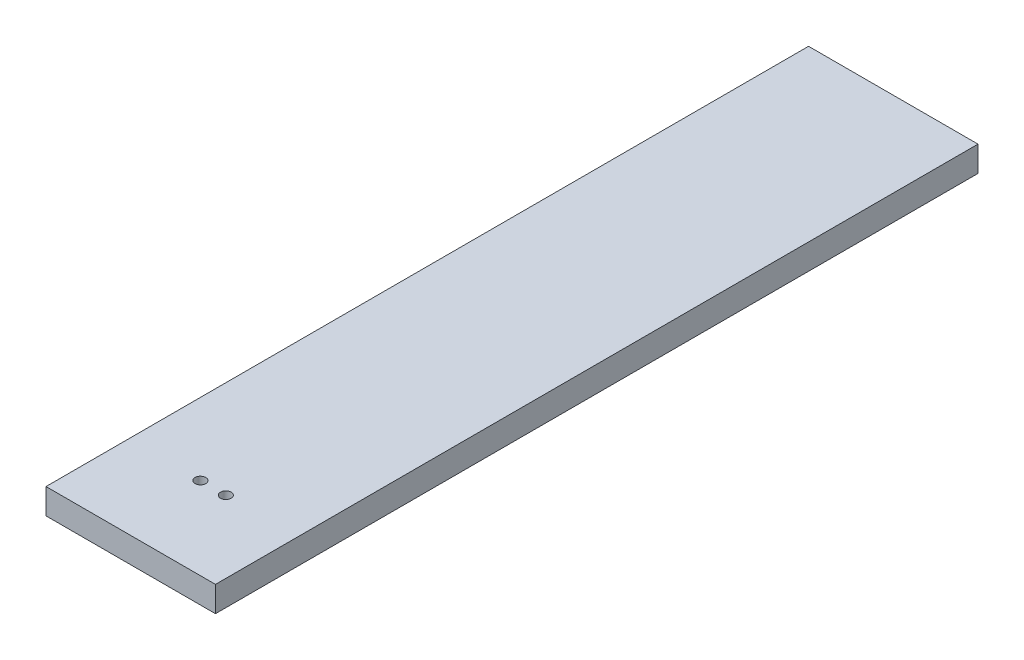
ISO-10303-21;
HEADER;
FILE_DESCRIPTION(('STEP AP214'),'2;1');
FILE_NAME('part.step','',(''),(''),'','','');
FILE_SCHEMA(('AUTOMOTIVE_DESIGN { 1 0 10303 214 1 1 1 1 }'));
ENDSEC;
DATA;
#1=APPLICATION_CONTEXT('core data for automotive mechanical design processes');
#2=APPLICATION_PROTOCOL_DEFINITION('international standard','automotive_design',2000,#1);
#3=PRODUCT_CONTEXT('',#1,'mechanical');
#4=PRODUCT('Part','Part','',(#3));
#5=PRODUCT_RELATED_PRODUCT_CATEGORY('part','',(#4));
#6=PRODUCT_DEFINITION_FORMATION('','',#4);
#7=PRODUCT_DEFINITION_CONTEXT('part definition',#1,'design');
#8=PRODUCT_DEFINITION('design','',#6,#7);
#9=PRODUCT_DEFINITION_SHAPE('','',#8);
#10=(LENGTH_UNIT() NAMED_UNIT(*) SI_UNIT(.MILLI.,.METRE.));
#11=(NAMED_UNIT(*) PLANE_ANGLE_UNIT() SI_UNIT($,.RADIAN.));
#12=(NAMED_UNIT(*) SI_UNIT($,.STERADIAN.) SOLID_ANGLE_UNIT());
#13=UNCERTAINTY_MEASURE_WITH_UNIT(LENGTH_MEASURE(1.E-05),#10,'distance_accuracy_value','');
#14=(GEOMETRIC_REPRESENTATION_CONTEXT(3) GLOBAL_UNCERTAINTY_ASSIGNED_CONTEXT((#13)) GLOBAL_UNIT_ASSIGNED_CONTEXT((#10,
#11,#12)) REPRESENTATION_CONTEXT('',''));
#15=CARTESIAN_POINT('',(0.,0.,0.));
#16=DIRECTION('',(0.,0.,1.));
#17=DIRECTION('',(1.,0.,0.));
#18=AXIS2_PLACEMENT_3D('',#15,#16,#17);
#19=CARTESIAN_POINT('',(7.9375,-2.38125,-35.71875));
#20=DIRECTION('',(1.,0.,0.));
#21=DIRECTION('',(0.,0.,-1.));
#22=AXIS2_PLACEMENT_3D('',#19,#20,#21);
#23=PLANE('',#22);
#24=DIRECTION('',(0.,0.,-1.));
#25=VECTOR('',#24,1.);
#26=CARTESIAN_POINT('',(7.9375,0.,-35.71875));
#27=LINE('',#26,#25);
#28=CARTESIAN_POINT('',(7.93750000000001,0.,35.71875));
#29=VERTEX_POINT('',#28);
#30=CARTESIAN_POINT('',(7.9375,0.,-35.71875));
#31=VERTEX_POINT('',#30);
#32=EDGE_CURVE('E101',#29,#31,#27,.T.);
#33=ORIENTED_EDGE('',*,*,#32,.F.);
#34=DIRECTION('',(0.,1.,0.));
#35=VECTOR('',#34,1.);
#36=CARTESIAN_POINT('',(7.93750000000001,-2.38125,35.71875));
#37=LINE('',#36,#35);
#38=CARTESIAN_POINT('',(7.93750000000001,-2.38125,35.71875));
#39=VERTEX_POINT('',#38);
#40=EDGE_CURVE('E11',#39,#29,#37,.T.);
#41=ORIENTED_EDGE('',*,*,#40,.F.);
#42=DIRECTION('',(0.,0.,-1.));
#43=VECTOR('',#42,1.);
#44=CARTESIAN_POINT('',(7.9375,-2.38125,-35.71875));
#45=LINE('',#44,#43);
#46=CARTESIAN_POINT('',(7.9375,-2.38125,-35.71875));
#47=VERTEX_POINT('',#46);
#48=EDGE_CURVE('E94',#39,#47,#45,.T.);
#49=ORIENTED_EDGE('',*,*,#48,.T.);
#50=DIRECTION('',(0.,1.,0.));
#51=VECTOR('',#50,1.);
#52=CARTESIAN_POINT('',(7.9375,-2.38125,-35.71875));
#53=LINE('',#52,#51);
#54=EDGE_CURVE('E39',#47,#31,#53,.T.);
#55=ORIENTED_EDGE('',*,*,#54,.T.);
#56=EDGE_LOOP('',(#33,#41,#49,#55));
#57=FACE_BOUND('',#56,.T.);
#58=ADVANCED_FACE('F36',(#57),#23,.T.);
#59=CARTESIAN_POINT('',(-7.93749999999999,-2.38125,35.71875));
#60=DIRECTION('',(0.,0.,1.));
#61=DIRECTION('',(1.,0.,0.));
#62=AXIS2_PLACEMENT_3D('',#59,#60,#61);
#63=PLANE('',#62);
#64=DIRECTION('',(1.,0.,0.));
#65=VECTOR('',#64,1.);
#66=CARTESIAN_POINT('',(-7.93749999999999,0.,35.71875));
#67=LINE('',#66,#65);
#68=CARTESIAN_POINT('',(-7.93749999999999,0.,35.71875));
#69=VERTEX_POINT('',#68);
#70=EDGE_CURVE('E96',#69,#29,#67,.T.);
#71=ORIENTED_EDGE('',*,*,#70,.F.);
#72=DIRECTION('',(0.,1.,0.));
#73=VECTOR('',#72,1.);
#74=CARTESIAN_POINT('',(-7.93749999999999,-2.38125,35.71875));
#75=LINE('',#74,#73);
#76=CARTESIAN_POINT('',(-7.93749999999999,-2.38125,35.71875));
#77=VERTEX_POINT('',#76);
#78=EDGE_CURVE('E45',#77,#69,#75,.T.);
#79=ORIENTED_EDGE('',*,*,#78,.F.);
#80=DIRECTION('',(1.,0.,0.));
#81=VECTOR('',#80,1.);
#82=CARTESIAN_POINT('',(-7.93749999999999,-2.38125,35.71875));
#83=LINE('',#82,#81);
#84=EDGE_CURVE('E91',#77,#39,#83,.T.);
#85=ORIENTED_EDGE('',*,*,#84,.T.);
#86=ORIENTED_EDGE('',*,*,#40,.T.);
#87=EDGE_LOOP('',(#71,#79,#85,#86));
#88=FACE_BOUND('',#87,.T.);
#89=ADVANCED_FACE('F112',(#88),#63,.T.);
#90=CARTESIAN_POINT('',(-7.9375,-2.38125,-35.71875));
#91=DIRECTION('',(-1.,0.,0.));
#92=DIRECTION('',(0.,0.,1.));
#93=AXIS2_PLACEMENT_3D('',#90,#91,#92);
#94=PLANE('',#93);
#95=DIRECTION('',(0.,0.,1.));
#96=VECTOR('',#95,1.);
#97=CARTESIAN_POINT('',(-7.9375,0.,-35.71875));
#98=LINE('',#97,#96);
#99=CARTESIAN_POINT('',(-7.9375,0.,-35.71875));
#100=VERTEX_POINT('',#99);
#101=EDGE_CURVE('E86',#100,#69,#98,.T.);
#102=ORIENTED_EDGE('',*,*,#101,.F.);
#103=DIRECTION('',(0.,1.,0.));
#104=VECTOR('',#103,1.);
#105=CARTESIAN_POINT('',(-7.9375,-2.38125,-35.71875));
#106=LINE('',#105,#104);
#107=CARTESIAN_POINT('',(-7.9375,-2.38125,-35.71875));
#108=VERTEX_POINT('',#107);
#109=EDGE_CURVE('E81',#108,#100,#106,.T.);
#110=ORIENTED_EDGE('',*,*,#109,.F.);
#111=DIRECTION('',(0.,0.,1.));
#112=VECTOR('',#111,1.);
#113=CARTESIAN_POINT('',(-7.9375,-2.38125,-35.71875));
#114=LINE('',#113,#112);
#115=EDGE_CURVE('E84',#108,#77,#114,.T.);
#116=ORIENTED_EDGE('',*,*,#115,.T.);
#117=ORIENTED_EDGE('',*,*,#78,.T.);
#118=EDGE_LOOP('',(#102,#110,#116,#117));
#119=FACE_BOUND('',#118,.T.);
#120=ADVANCED_FACE('F83',(#119),#94,.T.);
#121=CARTESIAN_POINT('',(-7.9375,-2.38125,-35.71875));
#122=DIRECTION('',(0.,0.,-1.));
#123=DIRECTION('',(-1.,0.,0.));
#124=AXIS2_PLACEMENT_3D('',#121,#122,#123);
#125=PLANE('',#124);
#126=DIRECTION('',(-1.,0.,0.));
#127=VECTOR('',#126,1.);
#128=CARTESIAN_POINT('',(-7.9375,0.,-35.71875));
#129=LINE('',#128,#127);
#130=EDGE_CURVE('E104',#31,#100,#129,.T.);
#131=ORIENTED_EDGE('',*,*,#130,.F.);
#132=ORIENTED_EDGE('',*,*,#54,.F.);
#133=DIRECTION('',(-1.,0.,0.));
#134=VECTOR('',#133,1.);
#135=CARTESIAN_POINT('',(-7.9375,-2.38125,-35.71875));
#136=LINE('',#135,#134);
#137=EDGE_CURVE('E90',#47,#108,#136,.T.);
#138=ORIENTED_EDGE('',*,*,#137,.T.);
#139=ORIENTED_EDGE('',*,*,#109,.T.);
#140=EDGE_LOOP('',(#131,#132,#138,#139));
#141=FACE_BOUND('',#140,.T.);
#142=ADVANCED_FACE('F93',(#141),#125,.T.);
#143=CARTESIAN_POINT('',(0.,-2.38125,0.));
#144=DIRECTION('',(0.,1.,0.));
#145=DIRECTION('',(0.,0.,1.));
#146=AXIS2_PLACEMENT_3D('',#143,#144,#145);
#147=PLANE('',#146);
#148=CARTESIAN_POINT('',(1.19,-2.38125,28.));
#149=DIRECTION('',(0.,1.,0.));
#150=DIRECTION('',(0.,0.,1.));
#151=AXIS2_PLACEMENT_3D('',#148,#149,#150);
#152=CIRCLE('',#151,0.5);
#153=CARTESIAN_POINT('',(1.19,-2.38125,28.5));
#154=VERTEX_POINT('',#153);
#155=EDGE_CURVE('E145',#154,#154,#152,.T.);
#156=ORIENTED_EDGE('',*,*,#155,.T.);
#157=EDGE_LOOP('',(#156));
#158=FACE_BOUND('',#157,.T.);
#159=CARTESIAN_POINT('',(-1.19,-2.38125,28.));
#160=DIRECTION('',(0.,1.,0.));
#161=DIRECTION('',(0.,0.,1.));
#162=AXIS2_PLACEMENT_3D('',#159,#160,#161);
#163=CIRCLE('',#162,0.5);
#164=CARTESIAN_POINT('',(-1.19,-2.38125,28.5));
#165=VERTEX_POINT('',#164);
#166=EDGE_CURVE('E105',#165,#165,#163,.T.);
#167=ORIENTED_EDGE('',*,*,#166,.T.);
#168=EDGE_LOOP('',(#167));
#169=FACE_BOUND('',#168,.T.);
#170=ORIENTED_EDGE('',*,*,#48,.F.);
#171=ORIENTED_EDGE('',*,*,#84,.F.);
#172=ORIENTED_EDGE('',*,*,#115,.F.);
#173=ORIENTED_EDGE('',*,*,#137,.F.);
#174=EDGE_LOOP('',(#170,#171,#172,#173));
#175=FACE_BOUND('',#174,.T.);
#176=ADVANCED_FACE('F89',(#158,#169,#175),#147,.F.);
#177=CARTESIAN_POINT('',(0.,0.,0.));
#178=DIRECTION('',(0.,1.,0.));
#179=DIRECTION('',(0.,0.,1.));
#180=AXIS2_PLACEMENT_3D('',#177,#178,#179);
#181=PLANE('',#180);
#182=CARTESIAN_POINT('',(1.19,0.,28.));
#183=DIRECTION('',(0.,1.,0.));
#184=DIRECTION('',(0.,0.,1.));
#185=AXIS2_PLACEMENT_3D('',#182,#183,#184);
#186=CIRCLE('',#185,0.5);
#187=CARTESIAN_POINT('',(1.19,0.,28.5));
#188=VERTEX_POINT('',#187);
#189=EDGE_CURVE('E148',#188,#188,#186,.T.);
#190=ORIENTED_EDGE('',*,*,#189,.F.);
#191=EDGE_LOOP('',(#190));
#192=FACE_BOUND('',#191,.T.);
#193=CARTESIAN_POINT('',(-1.19,0.,28.));
#194=DIRECTION('',(0.,1.,0.));
#195=DIRECTION('',(0.,0.,1.));
#196=AXIS2_PLACEMENT_3D('',#193,#194,#195);
#197=CIRCLE('',#196,0.5);
#198=CARTESIAN_POINT('',(-1.19,0.,28.5));
#199=VERTEX_POINT('',#198);
#200=EDGE_CURVE('E150',#199,#199,#197,.T.);
#201=ORIENTED_EDGE('',*,*,#200,.F.);
#202=EDGE_LOOP('',(#201));
#203=FACE_BOUND('',#202,.T.);
#204=ORIENTED_EDGE('',*,*,#32,.T.);
#205=ORIENTED_EDGE('',*,*,#130,.T.);
#206=ORIENTED_EDGE('',*,*,#101,.T.);
#207=ORIENTED_EDGE('',*,*,#70,.T.);
#208=EDGE_LOOP('',(#204,#205,#206,#207));
#209=FACE_BOUND('',#208,.T.);
#210=ADVANCED_FACE('F111',(#192,#203,#209),#181,.T.);
#211=CARTESIAN_POINT('',(-1.19,-2.38125,28.));
#212=DIRECTION('',(0.,1.,0.));
#213=DIRECTION('',(0.,0.,1.));
#214=AXIS2_PLACEMENT_3D('',#211,#212,#213);
#215=CYLINDRICAL_SURFACE('',#214,0.5);
#216=ORIENTED_EDGE('',*,*,#166,.F.);
#217=EDGE_LOOP('',(#216));
#218=FACE_BOUND('',#217,.T.);
#219=ORIENTED_EDGE('',*,*,#200,.T.);
#220=EDGE_LOOP('',(#219));
#221=FACE_BOUND('',#220,.T.);
#222=ADVANCED_FACE('F130',(#218,#221),#215,.F.);
#223=CARTESIAN_POINT('',(1.19,-2.38125,28.));
#224=DIRECTION('',(0.,1.,0.));
#225=DIRECTION('',(0.,0.,1.));
#226=AXIS2_PLACEMENT_3D('',#223,#224,#225);
#227=CYLINDRICAL_SURFACE('',#226,0.5);
#228=ORIENTED_EDGE('',*,*,#155,.F.);
#229=EDGE_LOOP('',(#228));
#230=FACE_BOUND('',#229,.T.);
#231=ORIENTED_EDGE('',*,*,#189,.T.);
#232=EDGE_LOOP('',(#231));
#233=FACE_BOUND('',#232,.T.);
#234=ADVANCED_FACE('F137',(#230,#233),#227,.F.);
#235=CLOSED_SHELL('',(#58,#89,#120,#142,#176,#210,#222,#234));
#236=MANIFOLD_SOLID_BREP('B2',#235);
#237=ADVANCED_BREP_SHAPE_REPRESENTATION('',(#18,#236),#14);
#238=SHAPE_DEFINITION_REPRESENTATION(#9,#237);
ENDSEC;
END-ISO-10303-21;
